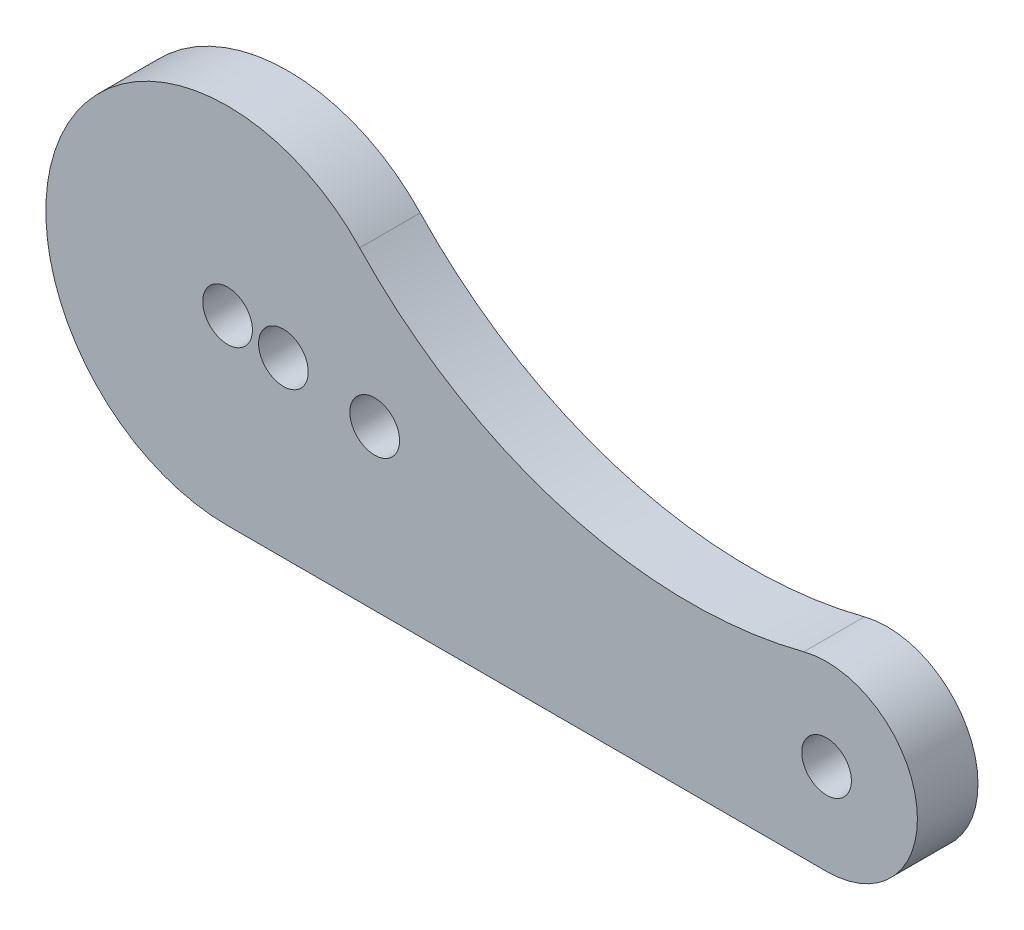
ISO-10303-21;
HEADER;
FILE_DESCRIPTION(('STEP AP214'),'2;1');
FILE_NAME('part.step','',(''),(''),'','','');
FILE_SCHEMA(('AUTOMOTIVE_DESIGN { 1 0 10303 214 1 1 1 1 }'));
ENDSEC;
DATA;
#1=APPLICATION_CONTEXT('core data for automotive mechanical design processes');
#2=APPLICATION_PROTOCOL_DEFINITION('international standard','automotive_design',2000,#1);
#3=PRODUCT_CONTEXT('',#1,'mechanical');
#4=PRODUCT('Part','Part','',(#3));
#5=PRODUCT_RELATED_PRODUCT_CATEGORY('part','',(#4));
#6=PRODUCT_DEFINITION_FORMATION('','',#4);
#7=PRODUCT_DEFINITION_CONTEXT('part definition',#1,'design');
#8=PRODUCT_DEFINITION('design','',#6,#7);
#9=PRODUCT_DEFINITION_SHAPE('','',#8);
#10=(LENGTH_UNIT() NAMED_UNIT(*) SI_UNIT(.MILLI.,.METRE.));
#11=(NAMED_UNIT(*) PLANE_ANGLE_UNIT() SI_UNIT($,.RADIAN.));
#12=(NAMED_UNIT(*) SI_UNIT($,.STERADIAN.) SOLID_ANGLE_UNIT());
#13=UNCERTAINTY_MEASURE_WITH_UNIT(LENGTH_MEASURE(1.E-05),#10,'distance_accuracy_value','');
#14=(GEOMETRIC_REPRESENTATION_CONTEXT(3) GLOBAL_UNCERTAINTY_ASSIGNED_CONTEXT((#13)) GLOBAL_UNIT_ASSIGNED_CONTEXT((#10,
#11,#12)) REPRESENTATION_CONTEXT('',''));
#15=CARTESIAN_POINT('',(0.,0.,0.));
#16=DIRECTION('',(0.,0.,1.));
#17=DIRECTION('',(1.,0.,0.));
#18=AXIS2_PLACEMENT_3D('',#15,#16,#17);
#19=CARTESIAN_POINT('',(0.,0.,5.));
#20=DIRECTION('',(0.,0.,1.));
#21=DIRECTION('',(1.,0.,0.));
#22=AXIS2_PLACEMENT_3D('',#19,#20,#21);
#23=PLANE('',#22);
#24=CARTESIAN_POINT('',(4.60816656185244,-0.699135,5.));
#25=DIRECTION('',(0.,0.,1.));
#26=DIRECTION('',(1.,0.,0.));
#27=AXIS2_PLACEMENT_3D('',#24,#25,#26);
#28=CIRCLE('',#27,2.05);
#29=CARTESIAN_POINT('',(6.65816656185245,-0.699135,5.));
#30=VERTEX_POINT('',#29);
#31=EDGE_CURVE('E132',#30,#30,#28,.T.);
#32=ORIENTED_EDGE('',*,*,#31,.F.);
#33=EDGE_LOOP('',(#32));
#34=FACE_BOUND('',#33,.T.);
#35=CARTESIAN_POINT('',(12.1419538564341,-1.842135,5.));
#36=DIRECTION('',(0.,0.,1.));
#37=DIRECTION('',(1.,0.,0.));
#38=AXIS2_PLACEMENT_3D('',#35,#36,#37);
#39=CIRCLE('',#38,2.05);
#40=CARTESIAN_POINT('',(14.1919538564341,-1.842135,5.));
#41=VERTEX_POINT('',#40);
#42=EDGE_CURVE('E129',#41,#41,#39,.T.);
#43=ORIENTED_EDGE('',*,*,#42,.F.);
#44=EDGE_LOOP('',(#43));
#45=FACE_BOUND('',#44,.T.);
#46=CARTESIAN_POINT('',(0.,0.,5.));
#47=DIRECTION('',(0.,0.,1.));
#48=DIRECTION('',(1.,0.,0.));
#49=AXIS2_PLACEMENT_3D('',#46,#47,#48);
#50=CIRCLE('',#49,2.05);
#51=CARTESIAN_POINT('',(2.05,0.,5.));
#52=VERTEX_POINT('',#51);
#53=EDGE_CURVE('E105',#52,#52,#50,.T.);
#54=ORIENTED_EDGE('',*,*,#53,.F.);
#55=EDGE_LOOP('',(#54));
#56=FACE_BOUND('',#55,.T.);
#57=CARTESIAN_POINT('',(0.,0.,5.));
#58=DIRECTION('',(0.,0.,1.));
#59=DIRECTION('',(1.,0.,0.));
#60=AXIS2_PLACEMENT_3D('',#57,#58,#59);
#61=CIRCLE('',#60,15.);
#62=CARTESIAN_POINT('',(10.9010401896387,10.3037528495147,5.));
#63=VERTEX_POINT('',#62);
#64=CARTESIAN_POINT('',(0.,-15.,5.));
#65=VERTEX_POINT('',#64);
#66=EDGE_CURVE('E90',#63,#65,#61,.T.);
#67=ORIENTED_EDGE('',*,*,#66,.T.);
#68=DIRECTION('',(1.,0.,0.));
#69=VECTOR('',#68,1.);
#70=CARTESIAN_POINT('',(0.,-15.,5.));
#71=LINE('',#70,#69);
#72=CARTESIAN_POINT('',(49.434299833213,-15.,5.));
#73=VERTEX_POINT('',#72);
#74=EDGE_CURVE('E85',#65,#73,#71,.T.);
#75=ORIENTED_EDGE('',*,*,#74,.T.);
#76=CARTESIAN_POINT('',(49.434299833213,-7.5,5.));
#77=DIRECTION('',(0.,0.,1.));
#78=DIRECTION('',(1.,0.,0.));
#79=AXIS2_PLACEMENT_3D('',#76,#77,#78);
#80=CIRCLE('',#79,7.50000000000001);
#81=CARTESIAN_POINT('',(47.5541899716334,-0.239477504449751,5.));
#82=VERTEX_POINT('',#81);
#83=EDGE_CURVE('E88',#73,#82,#80,.T.);
#84=ORIENTED_EDGE('',*,*,#83,.T.);
#85=CARTESIAN_POINT('',(38.1536406637354,36.0631349733015,5.));
#86=DIRECTION('',(0.,0.,-1.));
#87=DIRECTION('',(1.,0.,0.));
#88=AXIS2_PLACEMENT_3D('',#85,#86,#87);
#89=CIRCLE('',#88,37.5);
#90=EDGE_CURVE('E55',#82,#63,#89,.T.);
#91=ORIENTED_EDGE('',*,*,#90,.T.);
#92=EDGE_LOOP('',(#67,#75,#84,#91));
#93=FACE_BOUND('',#92,.T.);
#94=CARTESIAN_POINT('',(49.434299833213,-7.5,5.));
#95=DIRECTION('',(0.,0.,1.));
#96=DIRECTION('',(1.,0.,0.));
#97=AXIS2_PLACEMENT_3D('',#94,#95,#96);
#98=CIRCLE('',#97,2.04999999999999);
#99=CARTESIAN_POINT('',(51.484299833213,-7.5,5.));
#100=VERTEX_POINT('',#99);
#101=EDGE_CURVE('E120',#100,#100,#98,.T.);
#102=ORIENTED_EDGE('',*,*,#101,.F.);
#103=EDGE_LOOP('',(#102));
#104=FACE_BOUND('',#103,.T.);
#105=ADVANCED_FACE('F38',(#34,#45,#56,#93,#104),#23,.T.);
#106=CARTESIAN_POINT('',(0.,0.,0.));
#107=DIRECTION('',(0.,0.,1.));
#108=DIRECTION('',(1.,0.,0.));
#109=AXIS2_PLACEMENT_3D('',#106,#107,#108);
#110=PLANE('',#109);
#111=CARTESIAN_POINT('',(4.60816656185244,-0.699135,0.));
#112=DIRECTION('',(0.,0.,1.));
#113=DIRECTION('',(1.,0.,0.));
#114=AXIS2_PLACEMENT_3D('',#111,#112,#113);
#115=CIRCLE('',#114,2.05);
#116=CARTESIAN_POINT('',(6.65816656185245,-0.699135,0.));
#117=VERTEX_POINT('',#116);
#118=EDGE_CURVE('E126',#117,#117,#115,.F.);
#119=ORIENTED_EDGE('',*,*,#118,.F.);
#120=EDGE_LOOP('',(#119));
#121=FACE_BOUND('',#120,.T.);
#122=CARTESIAN_POINT('',(12.1419538564341,-1.842135,0.));
#123=DIRECTION('',(0.,0.,1.));
#124=DIRECTION('',(1.,0.,0.));
#125=AXIS2_PLACEMENT_3D('',#122,#123,#124);
#126=CIRCLE('',#125,2.05);
#127=CARTESIAN_POINT('',(14.1919538564341,-1.842135,0.));
#128=VERTEX_POINT('',#127);
#129=EDGE_CURVE('E133',#128,#128,#126,.F.);
#130=ORIENTED_EDGE('',*,*,#129,.F.);
#131=EDGE_LOOP('',(#130));
#132=FACE_BOUND('',#131,.T.);
#133=CARTESIAN_POINT('',(0.,0.,0.));
#134=DIRECTION('',(0.,0.,1.));
#135=DIRECTION('',(1.,0.,0.));
#136=AXIS2_PLACEMENT_3D('',#133,#134,#135);
#137=CIRCLE('',#136,15.);
#138=CARTESIAN_POINT('',(10.9010401896387,10.3037528495147,0.));
#139=VERTEX_POINT('',#138);
#140=CARTESIAN_POINT('',(0.,-15.,0.));
#141=VERTEX_POINT('',#140);
#142=EDGE_CURVE('E102',#139,#141,#137,.T.);
#143=ORIENTED_EDGE('',*,*,#142,.F.);
#144=CARTESIAN_POINT('',(38.1536406637354,36.0631349733015,0.));
#145=DIRECTION('',(0.,0.,-1.));
#146=DIRECTION('',(1.,0.,0.));
#147=AXIS2_PLACEMENT_3D('',#144,#145,#146);
#148=CIRCLE('',#147,37.5);
#149=CARTESIAN_POINT('',(47.5541899716334,-0.239477504449751,0.));
#150=VERTEX_POINT('',#149);
#151=EDGE_CURVE('E78',#150,#139,#148,.T.);
#152=ORIENTED_EDGE('',*,*,#151,.F.);
#153=CARTESIAN_POINT('',(49.434299833213,-7.5,0.));
#154=DIRECTION('',(0.,0.,1.));
#155=DIRECTION('',(1.,0.,0.));
#156=AXIS2_PLACEMENT_3D('',#153,#154,#155);
#157=CIRCLE('',#156,7.50000000000001);
#158=CARTESIAN_POINT('',(49.434299833213,-15.,0.));
#159=VERTEX_POINT('',#158);
#160=EDGE_CURVE('E72',#159,#150,#157,.T.);
#161=ORIENTED_EDGE('',*,*,#160,.F.);
#162=DIRECTION('',(1.,0.,0.));
#163=VECTOR('',#162,1.);
#164=CARTESIAN_POINT('',(0.,-15.,0.));
#165=LINE('',#164,#163);
#166=EDGE_CURVE('E94',#141,#159,#165,.T.);
#167=ORIENTED_EDGE('',*,*,#166,.F.);
#168=EDGE_LOOP('',(#143,#152,#161,#167));
#169=FACE_BOUND('',#168,.T.);
#170=CARTESIAN_POINT('',(0.,0.,0.));
#171=DIRECTION('',(0.,0.,1.));
#172=DIRECTION('',(1.,0.,0.));
#173=AXIS2_PLACEMENT_3D('',#170,#171,#172);
#174=CIRCLE('',#173,2.05);
#175=CARTESIAN_POINT('',(2.05,0.,0.));
#176=VERTEX_POINT('',#175);
#177=EDGE_CURVE('E117',#176,#176,#174,.T.);
#178=ORIENTED_EDGE('',*,*,#177,.T.);
#179=EDGE_LOOP('',(#178));
#180=FACE_BOUND('',#179,.T.);
#181=CARTESIAN_POINT('',(49.434299833213,-7.5,0.));
#182=DIRECTION('',(0.,0.,1.));
#183=DIRECTION('',(1.,0.,0.));
#184=AXIS2_PLACEMENT_3D('',#181,#182,#183);
#185=CIRCLE('',#184,2.04999999999999);
#186=CARTESIAN_POINT('',(51.484299833213,-7.5,0.));
#187=VERTEX_POINT('',#186);
#188=EDGE_CURVE('E123',#187,#187,#185,.T.);
#189=ORIENTED_EDGE('',*,*,#188,.T.);
#190=EDGE_LOOP('',(#189));
#191=FACE_BOUND('',#190,.T.);
#192=ADVANCED_FACE('F113',(#121,#132,#169,#180,#191),#110,.F.);
#193=CARTESIAN_POINT('',(0.,0.,5.));
#194=DIRECTION('',(0.,0.,-1.));
#195=DIRECTION('',(-1.,0.,0.));
#196=AXIS2_PLACEMENT_3D('',#193,#194,#195);
#197=CYLINDRICAL_SURFACE('',#196,15.);
#198=ORIENTED_EDGE('',*,*,#142,.T.);
#199=DIRECTION('',(0.,0.,-1.));
#200=VECTOR('',#199,1.);
#201=CARTESIAN_POINT('',(0.,-15.,5.));
#202=LINE('',#201,#200);
#203=EDGE_CURVE('E11',#65,#141,#202,.T.);
#204=ORIENTED_EDGE('',*,*,#203,.F.);
#205=ORIENTED_EDGE('',*,*,#66,.F.);
#206=DIRECTION('',(0.,0.,-1.));
#207=VECTOR('',#206,1.);
#208=CARTESIAN_POINT('',(10.9010401896387,10.3037528495147,5.));
#209=LINE('',#208,#207);
#210=EDGE_CURVE('E98',#63,#139,#209,.T.);
#211=ORIENTED_EDGE('',*,*,#210,.T.);
#212=EDGE_LOOP('',(#198,#204,#205,#211));
#213=FACE_BOUND('',#212,.T.);
#214=ADVANCED_FACE('F40',(#213),#197,.T.);
#215=CARTESIAN_POINT('',(0.,-15.,5.));
#216=DIRECTION('',(0.,1.,0.));
#217=DIRECTION('',(0.,0.,1.));
#218=AXIS2_PLACEMENT_3D('',#215,#216,#217);
#219=PLANE('',#218);
#220=ORIENTED_EDGE('',*,*,#166,.T.);
#221=DIRECTION('',(0.,0.,-1.));
#222=VECTOR('',#221,1.);
#223=CARTESIAN_POINT('',(49.434299833213,-15.,5.));
#224=LINE('',#223,#222);
#225=EDGE_CURVE('E47',#73,#159,#224,.T.);
#226=ORIENTED_EDGE('',*,*,#225,.F.);
#227=ORIENTED_EDGE('',*,*,#74,.F.);
#228=ORIENTED_EDGE('',*,*,#203,.T.);
#229=EDGE_LOOP('',(#220,#226,#227,#228));
#230=FACE_BOUND('',#229,.T.);
#231=ADVANCED_FACE('F93',(#230),#219,.F.);
#232=CARTESIAN_POINT('',(49.434299833213,-7.5,5.));
#233=DIRECTION('',(0.,0.,-1.));
#234=DIRECTION('',(-1.,0.,0.));
#235=AXIS2_PLACEMENT_3D('',#232,#233,#234);
#236=CYLINDRICAL_SURFACE('',#235,7.50000000000001);
#237=ORIENTED_EDGE('',*,*,#160,.T.);
#238=DIRECTION('',(0.,0.,-1.));
#239=VECTOR('',#238,1.);
#240=CARTESIAN_POINT('',(47.5541899716334,-0.239477504449751,5.));
#241=LINE('',#240,#239);
#242=EDGE_CURVE('E95',#82,#150,#241,.T.);
#243=ORIENTED_EDGE('',*,*,#242,.F.);
#244=ORIENTED_EDGE('',*,*,#83,.F.);
#245=ORIENTED_EDGE('',*,*,#225,.T.);
#246=EDGE_LOOP('',(#237,#243,#244,#245));
#247=FACE_BOUND('',#246,.T.);
#248=ADVANCED_FACE('F96',(#247),#236,.T.);
#249=CARTESIAN_POINT('',(38.1536406637354,36.0631349733015,5.));
#250=DIRECTION('',(0.,0.,-1.));
#251=DIRECTION('',(-1.,0.,0.));
#252=AXIS2_PLACEMENT_3D('',#249,#250,#251);
#253=CYLINDRICAL_SURFACE('',#252,37.5);
#254=ORIENTED_EDGE('',*,*,#151,.T.);
#255=ORIENTED_EDGE('',*,*,#210,.F.);
#256=ORIENTED_EDGE('',*,*,#90,.F.);
#257=ORIENTED_EDGE('',*,*,#242,.T.);
#258=EDGE_LOOP('',(#254,#255,#256,#257));
#259=FACE_BOUND('',#258,.T.);
#260=ADVANCED_FACE('F110',(#259),#253,.F.);
#261=CARTESIAN_POINT('',(0.,0.,5.));
#262=DIRECTION('',(0.,0.,-1.));
#263=DIRECTION('',(-1.,0.,0.));
#264=AXIS2_PLACEMENT_3D('',#261,#262,#263);
#265=CYLINDRICAL_SURFACE('',#264,2.05);
#266=ORIENTED_EDGE('',*,*,#53,.T.);
#267=EDGE_LOOP('',(#266));
#268=FACE_BOUND('',#267,.T.);
#269=ORIENTED_EDGE('',*,*,#177,.F.);
#270=EDGE_LOOP('',(#269));
#271=FACE_BOUND('',#270,.T.);
#272=ADVANCED_FACE('F151',(#268,#271),#265,.F.);
#273=CARTESIAN_POINT('',(49.434299833213,-7.5,5.));
#274=DIRECTION('',(0.,0.,-1.));
#275=DIRECTION('',(-1.,0.,0.));
#276=AXIS2_PLACEMENT_3D('',#273,#274,#275);
#277=CYLINDRICAL_SURFACE('',#276,2.04999999999999);
#278=ORIENTED_EDGE('',*,*,#101,.T.);
#279=EDGE_LOOP('',(#278));
#280=FACE_BOUND('',#279,.T.);
#281=ORIENTED_EDGE('',*,*,#188,.F.);
#282=EDGE_LOOP('',(#281));
#283=FACE_BOUND('',#282,.T.);
#284=ADVANCED_FACE('F154',(#280,#283),#277,.F.);
#285=CARTESIAN_POINT('',(12.1419538564341,-1.842135,-0.00100000000000013));
#286=DIRECTION('',(0.,0.,1.));
#287=DIRECTION('',(1.,0.,0.));
#288=AXIS2_PLACEMENT_3D('',#285,#286,#287);
#289=CYLINDRICAL_SURFACE('',#288,2.05);
#290=ORIENTED_EDGE('',*,*,#42,.T.);
#291=EDGE_LOOP('',(#290));
#292=FACE_BOUND('',#291,.T.);
#293=ORIENTED_EDGE('',*,*,#129,.T.);
#294=EDGE_LOOP('',(#293));
#295=FACE_BOUND('',#294,.T.);
#296=ADVANCED_FACE('F164',(#292,#295),#289,.F.);
#297=CARTESIAN_POINT('',(4.60816656185244,-0.699135,-0.00100000000000013));
#298=DIRECTION('',(0.,0.,1.));
#299=DIRECTION('',(1.,0.,0.));
#300=AXIS2_PLACEMENT_3D('',#297,#298,#299);
#301=CYLINDRICAL_SURFACE('',#300,2.05);
#302=ORIENTED_EDGE('',*,*,#31,.T.);
#303=EDGE_LOOP('',(#302));
#304=FACE_BOUND('',#303,.T.);
#305=ORIENTED_EDGE('',*,*,#118,.T.);
#306=EDGE_LOOP('',(#305));
#307=FACE_BOUND('',#306,.T.);
#308=ADVANCED_FACE('F141',(#304,#307),#301,.F.);
#309=CLOSED_SHELL('',(#105,#192,#214,#231,#248,#260,#272,#284,#296,#308));
#310=MANIFOLD_SOLID_BREP('B2',#309);
#311=ADVANCED_BREP_SHAPE_REPRESENTATION('',(#18,#310),#14);
#312=SHAPE_DEFINITION_REPRESENTATION(#9,#311);
ENDSEC;
END-ISO-10303-21;
